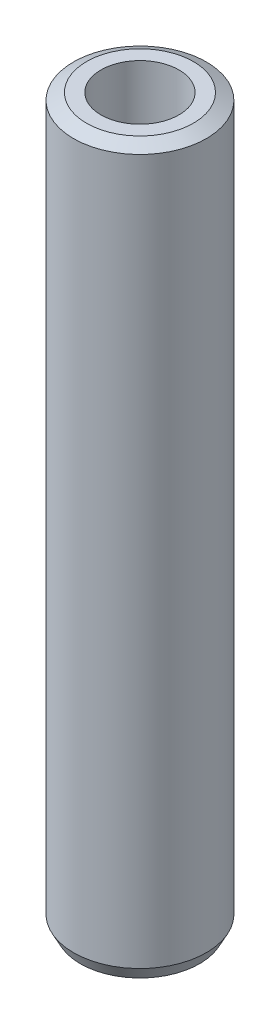
ISO-10303-21;
HEADER;
FILE_DESCRIPTION(('STEP AP214'),'2;1');
FILE_NAME('part.step','',(''),(''),'','','');
FILE_SCHEMA(('AUTOMOTIVE_DESIGN { 1 0 10303 214 1 1 1 1 }'));
ENDSEC;
DATA;
#1=APPLICATION_CONTEXT('core data for automotive mechanical design processes');
#2=APPLICATION_PROTOCOL_DEFINITION('international standard','automotive_design',2000,#1);
#3=PRODUCT_CONTEXT('',#1,'mechanical');
#4=PRODUCT('Part','Part','',(#3));
#5=PRODUCT_RELATED_PRODUCT_CATEGORY('part','',(#4));
#6=PRODUCT_DEFINITION_FORMATION('','',#4);
#7=PRODUCT_DEFINITION_CONTEXT('part definition',#1,'design');
#8=PRODUCT_DEFINITION('design','',#6,#7);
#9=PRODUCT_DEFINITION_SHAPE('','',#8);
#10=(LENGTH_UNIT() NAMED_UNIT(*) SI_UNIT(.MILLI.,.METRE.));
#11=(NAMED_UNIT(*) PLANE_ANGLE_UNIT() SI_UNIT($,.RADIAN.));
#12=(NAMED_UNIT(*) SI_UNIT($,.STERADIAN.) SOLID_ANGLE_UNIT());
#13=UNCERTAINTY_MEASURE_WITH_UNIT(LENGTH_MEASURE(1.E-05),#10,'distance_accuracy_value','');
#14=(GEOMETRIC_REPRESENTATION_CONTEXT(3) GLOBAL_UNCERTAINTY_ASSIGNED_CONTEXT((#13)) GLOBAL_UNIT_ASSIGNED_CONTEXT((#10,
#11,#12)) REPRESENTATION_CONTEXT('',''));
#15=CARTESIAN_POINT('',(0.,0.,0.));
#16=DIRECTION('',(0.,0.,1.));
#17=DIRECTION('',(1.,0.,0.));
#18=AXIS2_PLACEMENT_3D('',#15,#16,#17);
#19=CARTESIAN_POINT('',(0.,600.,0.));
#20=DIRECTION('',(0.,-1.,0.));
#21=DIRECTION('',(0.,0.,-1.));
#22=AXIS2_PLACEMENT_3D('',#19,#20,#21);
#23=CYLINDRICAL_SURFACE('',#22,55.);
#24=CARTESIAN_POINT('',(0.,594.374596568303,0.));
#25=DIRECTION('',(0.,1.,0.));
#26=DIRECTION('',(0.,0.,1.));
#27=AXIS2_PLACEMENT_3D('',#24,#25,#26);
#28=CIRCLE('',#27,55.);
#29=CARTESIAN_POINT('',(0.,594.374596568303,55.));
#30=VERTEX_POINT('',#29);
#31=EDGE_CURVE('E50',#30,#30,#28,.F.);
#32=ORIENTED_EDGE('',*,*,#31,.T.);
#33=EDGE_LOOP('',(#32));
#34=FACE_BOUND('',#33,.T.);
#35=CARTESIAN_POINT('',(0.,10.7684545854313,0.));
#36=DIRECTION('',(0.,1.,0.));
#37=DIRECTION('',(0.,0.,1.));
#38=AXIS2_PLACEMENT_3D('',#35,#36,#37);
#39=CIRCLE('',#38,55.);
#40=CARTESIAN_POINT('',(0.,10.7684545854313,55.));
#41=VERTEX_POINT('',#40);
#42=EDGE_CURVE('E51',#41,#41,#39,.T.);
#43=ORIENTED_EDGE('',*,*,#42,.T.);
#44=EDGE_LOOP('',(#43));
#45=FACE_BOUND('',#44,.T.);
#46=ADVANCED_FACE('F39',(#34,#45),#23,.T.);
#47=CARTESIAN_POINT('',(0.,600.,0.));
#48=DIRECTION('',(0.,1.,0.));
#49=DIRECTION('',(0.,0.,1.));
#50=AXIS2_PLACEMENT_3D('',#47,#48,#49);
#51=PLANE('',#50);
#52=CARTESIAN_POINT('',(0.,600.,0.));
#53=DIRECTION('',(0.,1.,0.));
#54=DIRECTION('',(0.,0.,1.));
#55=AXIS2_PLACEMENT_3D('',#52,#53,#54);
#56=CIRCLE('',#55,44.2315454145687);
#57=CARTESIAN_POINT('',(0.,600.,44.2315454145687));
#58=VERTEX_POINT('',#57);
#59=EDGE_CURVE('E54',#58,#58,#56,.T.);
#60=ORIENTED_EDGE('',*,*,#59,.T.);
#61=EDGE_LOOP('',(#60));
#62=FACE_BOUND('',#61,.T.);
#63=CARTESIAN_POINT('',(0.,600.,0.));
#64=DIRECTION('',(0.,1.,0.));
#65=DIRECTION('',(0.,0.,1.));
#66=AXIS2_PLACEMENT_3D('',#63,#64,#65);
#67=CIRCLE('',#66,32.2938226093213);
#68=CARTESIAN_POINT('',(0.,600.,32.2938226093213));
#69=VERTEX_POINT('',#68);
#70=EDGE_CURVE('E58',#69,#69,#67,.T.);
#71=ORIENTED_EDGE('',*,*,#70,.F.);
#72=EDGE_LOOP('',(#71));
#73=FACE_BOUND('',#72,.T.);
#74=ADVANCED_FACE('F69',(#62,#73),#51,.T.);
#75=CARTESIAN_POINT('',(0.,0.,0.));
#76=DIRECTION('',(0.,1.,0.));
#77=DIRECTION('',(0.,0.,1.));
#78=AXIS2_PLACEMENT_3D('',#75,#76,#77);
#79=PLANE('',#78);
#80=CARTESIAN_POINT('',(0.,0.,0.));
#81=DIRECTION('',(0.,1.,0.));
#82=DIRECTION('',(0.,0.,1.));
#83=AXIS2_PLACEMENT_3D('',#80,#81,#82);
#84=CIRCLE('',#83,49.3745965683032);
#85=CARTESIAN_POINT('',(0.,0.,49.3745965683032));
#86=VERTEX_POINT('',#85);
#87=EDGE_CURVE('E10',#86,#86,#84,.F.);
#88=ORIENTED_EDGE('',*,*,#87,.T.);
#89=EDGE_LOOP('',(#88));
#90=FACE_BOUND('',#89,.T.);
#91=CARTESIAN_POINT('',(0.,0.,0.));
#92=DIRECTION('',(0.,1.,0.));
#93=DIRECTION('',(0.,0.,1.));
#94=AXIS2_PLACEMENT_3D('',#91,#92,#93);
#95=CIRCLE('',#94,32.2938226093213);
#96=CARTESIAN_POINT('',(0.,0.,32.2938226093213));
#97=VERTEX_POINT('',#96);
#98=EDGE_CURVE('E63',#97,#97,#95,.T.);
#99=ORIENTED_EDGE('',*,*,#98,.T.);
#100=EDGE_LOOP('',(#99));
#101=FACE_BOUND('',#100,.T.);
#102=ADVANCED_FACE('F75',(#90,#101),#79,.F.);
#103=CARTESIAN_POINT('',(0.,600.,0.));
#104=DIRECTION('',(0.,-1.,0.));
#105=DIRECTION('',(0.,0.,-1.));
#106=AXIS2_PLACEMENT_3D('',#103,#104,#105);
#107=CYLINDRICAL_SURFACE('',#106,32.2938226093213);
#108=ORIENTED_EDGE('',*,*,#70,.T.);
#109=EDGE_LOOP('',(#108));
#110=FACE_BOUND('',#109,.T.);
#111=ORIENTED_EDGE('',*,*,#98,.F.);
#112=EDGE_LOOP('',(#111));
#113=FACE_BOUND('',#112,.T.);
#114=ADVANCED_FACE('F70',(#110,#113),#107,.F.);
#115=CARTESIAN_POINT('',(0.,600.,0.));
#116=DIRECTION('',(0.,-1.,0.));
#117=DIRECTION('',(0.,0.,-1.));
#118=AXIS2_PLACEMENT_3D('',#115,#116,#117);
#119=CONICAL_SURFACE('',#118,44.2315454145687,1.08939243941407);
#120=ORIENTED_EDGE('',*,*,#31,.F.);
#121=EDGE_LOOP('',(#120));
#122=FACE_BOUND('',#121,.T.);
#123=ORIENTED_EDGE('',*,*,#59,.F.);
#124=EDGE_LOOP('',(#123));
#125=FACE_BOUND('',#124,.T.);
#126=ADVANCED_FACE('F81',(#122,#125),#119,.T.);
#127=CARTESIAN_POINT('',(0.,10.7684545854313,0.));
#128=DIRECTION('',(0.,1.,0.));
#129=DIRECTION('',(0.,0.,1.));
#130=AXIS2_PLACEMENT_3D('',#127,#128,#129);
#131=CONICAL_SURFACE('',#130,55.,0.481403887380827);
#132=ORIENTED_EDGE('',*,*,#87,.F.);
#133=EDGE_LOOP('',(#132));
#134=FACE_BOUND('',#133,.T.);
#135=ORIENTED_EDGE('',*,*,#42,.F.);
#136=EDGE_LOOP('',(#135));
#137=FACE_BOUND('',#136,.T.);
#138=ADVANCED_FACE('F45',(#134,#137),#131,.T.);
#139=CLOSED_SHELL('',(#46,#74,#102,#114,#126,#138));
#140=MANIFOLD_SOLID_BREP('B2',#139);
#141=ADVANCED_BREP_SHAPE_REPRESENTATION('',(#18,#140),#14);
#142=SHAPE_DEFINITION_REPRESENTATION(#9,#141);
ENDSEC;
END-ISO-10303-21;
